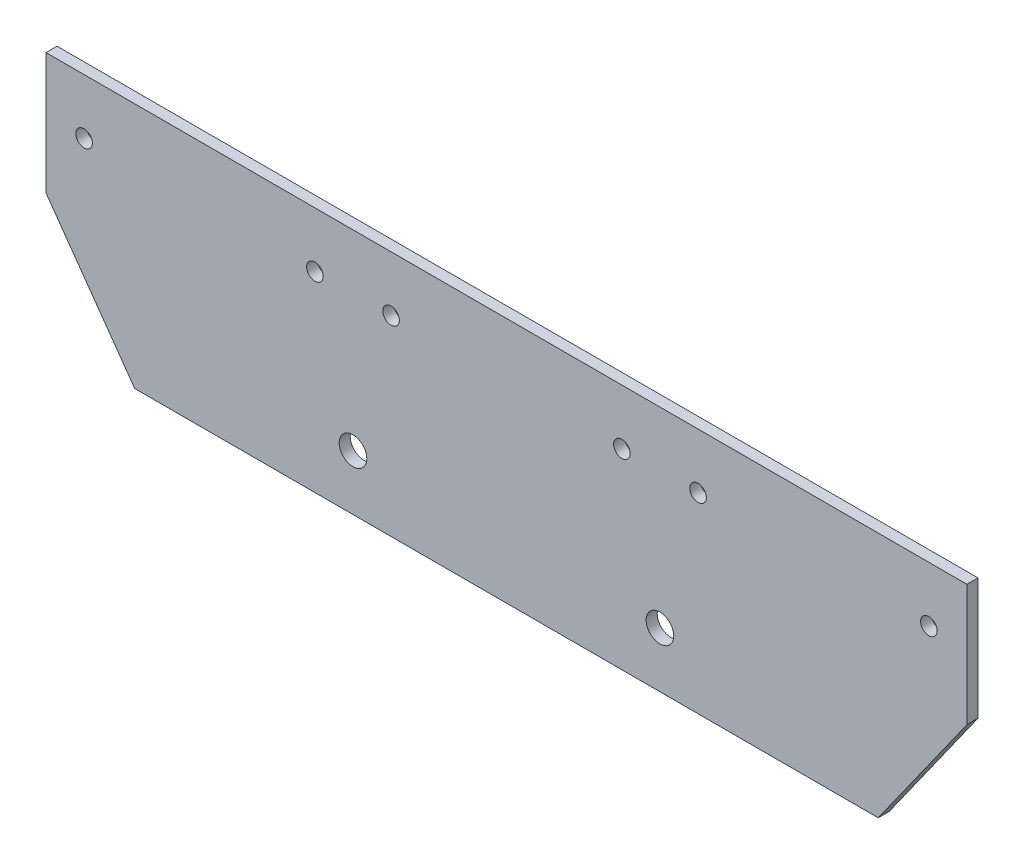
ISO-10303-21;
HEADER;
FILE_DESCRIPTION(('STEP AP214'),'2;1');
FILE_NAME('part.step','',(''),(''),'','','');
FILE_SCHEMA(('AUTOMOTIVE_DESIGN { 1 0 10303 214 1 1 1 1 }'));
ENDSEC;
DATA;
#1=APPLICATION_CONTEXT('core data for automotive mechanical design processes');
#2=APPLICATION_PROTOCOL_DEFINITION('international standard','automotive_design',2000,#1);
#3=PRODUCT_CONTEXT('',#1,'mechanical');
#4=PRODUCT('Part','Part','',(#3));
#5=PRODUCT_RELATED_PRODUCT_CATEGORY('part','',(#4));
#6=PRODUCT_DEFINITION_FORMATION('','',#4);
#7=PRODUCT_DEFINITION_CONTEXT('part definition',#1,'design');
#8=PRODUCT_DEFINITION('design','',#6,#7);
#9=PRODUCT_DEFINITION_SHAPE('','',#8);
#10=(LENGTH_UNIT() NAMED_UNIT(*) SI_UNIT(.MILLI.,.METRE.));
#11=(NAMED_UNIT(*) PLANE_ANGLE_UNIT() SI_UNIT($,.RADIAN.));
#12=(NAMED_UNIT(*) SI_UNIT($,.STERADIAN.) SOLID_ANGLE_UNIT());
#13=UNCERTAINTY_MEASURE_WITH_UNIT(LENGTH_MEASURE(1.E-05),#10,'distance_accuracy_value','');
#14=(GEOMETRIC_REPRESENTATION_CONTEXT(3) GLOBAL_UNCERTAINTY_ASSIGNED_CONTEXT((#13)) GLOBAL_UNIT_ASSIGNED_CONTEXT((#10,
#11,#12)) REPRESENTATION_CONTEXT('',''));
#15=CARTESIAN_POINT('',(0.,0.,0.));
#16=DIRECTION('',(0.,0.,1.));
#17=DIRECTION('',(1.,0.,0.));
#18=AXIS2_PLACEMENT_3D('',#15,#16,#17);
#19=CARTESIAN_POINT('',(43.2797832163817,-30.7058967031871,2.));
#20=DIRECTION('',(0.815585299862001,-0.578636862504464,0.));
#21=DIRECTION('',(0.578636862504464,0.815585299862001,0.));
#22=AXIS2_PLACEMENT_3D('',#19,#20,#21);
#23=PLANE('',#22);
#24=DIRECTION('',(-0.578636862504464,-0.815585299862001,0.));
#25=VECTOR('',#24,1.);
#26=CARTESIAN_POINT('',(43.2797832163817,-30.7058967031871,0.));
#27=LINE('',#26,#25);
#28=CARTESIAN_POINT('',(104.279502218763,55.2728532484216,0.));
#29=VERTEX_POINT('',#28);
#30=CARTESIAN_POINT('',(88.2240973448745,32.6428532484216,0.));
#31=VERTEX_POINT('',#30);
#32=EDGE_CURVE('E158',#29,#31,#27,.T.);
#33=ORIENTED_EDGE('',*,*,#32,.F.);
#34=DIRECTION('',(0.,0.,-1.));
#35=VECTOR('',#34,1.);
#36=CARTESIAN_POINT('',(104.279502218763,55.2728532484216,2.));
#37=LINE('',#36,#35);
#38=CARTESIAN_POINT('',(104.279502218763,55.2728532484216,2.));
#39=VERTEX_POINT('',#38);
#40=EDGE_CURVE('E11',#39,#29,#37,.T.);
#41=ORIENTED_EDGE('',*,*,#40,.F.);
#42=DIRECTION('',(-0.578636862504464,-0.815585299862001,0.));
#43=VECTOR('',#42,1.);
#44=CARTESIAN_POINT('',(43.2797832163817,-30.7058967031871,2.));
#45=LINE('',#44,#43);
#46=CARTESIAN_POINT('',(88.2240973448745,32.6428532484216,2.));
#47=VERTEX_POINT('',#46);
#48=EDGE_CURVE('E200',#39,#47,#45,.T.);
#49=ORIENTED_EDGE('',*,*,#48,.T.);
#50=DIRECTION('',(0.,0.,-1.));
#51=VECTOR('',#50,1.);
#52=CARTESIAN_POINT('',(88.2240973448745,32.6428532484216,2.));
#53=LINE('',#52,#51);
#54=EDGE_CURVE('E93',#47,#31,#53,.T.);
#55=ORIENTED_EDGE('',*,*,#54,.T.);
#56=EDGE_LOOP('',(#33,#41,#49,#55));
#57=FACE_BOUND('',#56,.T.);
#58=ADVANCED_FACE('F47',(#57),#23,.T.);
#59=CARTESIAN_POINT('',(104.279502218763,0.,2.));
#60=DIRECTION('',(-1.,0.,0.));
#61=DIRECTION('',(0.,0.,1.));
#62=AXIS2_PLACEMENT_3D('',#59,#60,#61);
#63=PLANE('',#62);
#64=DIRECTION('',(0.,1.,0.));
#65=VECTOR('',#64,1.);
#66=CARTESIAN_POINT('',(104.279502218763,0.,0.));
#67=LINE('',#66,#65);
#68=CARTESIAN_POINT('',(104.279502218763,77.2728532484216,0.));
#69=VERTEX_POINT('',#68);
#70=EDGE_CURVE('E162',#29,#69,#67,.T.);
#71=ORIENTED_EDGE('',*,*,#70,.T.);
#72=DIRECTION('',(0.,0.,-1.));
#73=VECTOR('',#72,1.);
#74=CARTESIAN_POINT('',(104.279502218763,77.2728532484216,2.));
#75=LINE('',#74,#73);
#76=CARTESIAN_POINT('',(104.279502218763,77.2728532484216,2.));
#77=VERTEX_POINT('',#76);
#78=EDGE_CURVE('E56',#77,#69,#75,.T.);
#79=ORIENTED_EDGE('',*,*,#78,.F.);
#80=DIRECTION('',(0.,1.,0.));
#81=VECTOR('',#80,1.);
#82=CARTESIAN_POINT('',(104.279502218763,0.,2.));
#83=LINE('',#82,#81);
#84=EDGE_CURVE('E221',#39,#77,#83,.T.);
#85=ORIENTED_EDGE('',*,*,#84,.F.);
#86=ORIENTED_EDGE('',*,*,#40,.T.);
#87=EDGE_LOOP('',(#71,#79,#85,#86));
#88=FACE_BOUND('',#87,.T.);
#89=ADVANCED_FACE('F267',(#88),#63,.F.);
#90=CARTESIAN_POINT('',(0.,77.2728532484216,2.));
#91=DIRECTION('',(0.,-1.,0.));
#92=DIRECTION('',(0.,0.,-1.));
#93=AXIS2_PLACEMENT_3D('',#90,#91,#92);
#94=PLANE('',#93);
#95=DIRECTION('',(-1.,0.,0.));
#96=VECTOR('',#95,1.);
#97=CARTESIAN_POINT('',(0.,77.2728532484216,0.));
#98=LINE('',#97,#96);
#99=CARTESIAN_POINT('',(-62.4029270245672,77.2728532484216,0.));
#100=VERTEX_POINT('',#99);
#101=EDGE_CURVE('E166',#69,#100,#98,.T.);
#102=ORIENTED_EDGE('',*,*,#101,.T.);
#103=DIRECTION('',(0.,0.,-1.));
#104=VECTOR('',#103,1.);
#105=CARTESIAN_POINT('',(-62.4029270245672,77.2728532484216,2.));
#106=LINE('',#105,#104);
#107=CARTESIAN_POINT('',(-62.4029270245672,77.2728532484216,2.));
#108=VERTEX_POINT('',#107);
#109=EDGE_CURVE('E124',#108,#100,#106,.T.);
#110=ORIENTED_EDGE('',*,*,#109,.F.);
#111=DIRECTION('',(-1.,0.,0.));
#112=VECTOR('',#111,1.);
#113=CARTESIAN_POINT('',(0.,77.2728532484216,2.));
#114=LINE('',#113,#112);
#115=EDGE_CURVE('E113',#77,#108,#114,.T.);
#116=ORIENTED_EDGE('',*,*,#115,.F.);
#117=ORIENTED_EDGE('',*,*,#78,.T.);
#118=EDGE_LOOP('',(#102,#110,#116,#117));
#119=FACE_BOUND('',#118,.T.);
#120=ADVANCED_FACE('F211',(#119),#94,.F.);
#121=CARTESIAN_POINT('',(-62.4029270245672,0.,2.));
#122=DIRECTION('',(1.,0.,0.));
#123=DIRECTION('',(0.,0.,-1.));
#124=AXIS2_PLACEMENT_3D('',#121,#122,#123);
#125=PLANE('',#124);
#126=DIRECTION('',(0.,-1.,0.));
#127=VECTOR('',#126,1.);
#128=CARTESIAN_POINT('',(-62.4029270245672,0.,0.));
#129=LINE('',#128,#127);
#130=CARTESIAN_POINT('',(-62.4029270245672,55.2728532484216,0.));
#131=VERTEX_POINT('',#130);
#132=EDGE_CURVE('E122',#100,#131,#129,.T.);
#133=ORIENTED_EDGE('',*,*,#132,.T.);
#134=DIRECTION('',(0.,0.,-1.));
#135=VECTOR('',#134,1.);
#136=CARTESIAN_POINT('',(-62.4029270245672,55.2728532484216,2.));
#137=LINE('',#136,#135);
#138=CARTESIAN_POINT('',(-62.4029270245672,55.2728532484216,2.));
#139=VERTEX_POINT('',#138);
#140=EDGE_CURVE('E119',#139,#131,#137,.T.);
#141=ORIENTED_EDGE('',*,*,#140,.F.);
#142=DIRECTION('',(0.,-1.,0.));
#143=VECTOR('',#142,1.);
#144=CARTESIAN_POINT('',(-62.4029270245672,0.,2.));
#145=LINE('',#144,#143);
#146=EDGE_CURVE('E106',#108,#139,#145,.T.);
#147=ORIENTED_EDGE('',*,*,#146,.F.);
#148=ORIENTED_EDGE('',*,*,#109,.T.);
#149=EDGE_LOOP('',(#133,#141,#147,#148));
#150=FACE_BOUND('',#149,.T.);
#151=ADVANCED_FACE('F120',(#150),#125,.F.);
#152=CARTESIAN_POINT('',(-15.4243488356085,-10.9431800915503,2.));
#153=DIRECTION('',(0.815585299862001,0.578636862504464,0.));
#154=DIRECTION('',(-0.578636862504464,0.815585299862001,0.));
#155=AXIS2_PLACEMENT_3D('',#152,#153,#154);
#156=PLANE('',#155);
#157=DIRECTION('',(0.578636862504464,-0.815585299862001,0.));
#158=VECTOR('',#157,1.);
#159=CARTESIAN_POINT('',(-15.4243488356085,-10.9431800915503,0.));
#160=LINE('',#159,#158);
#161=CARTESIAN_POINT('',(-46.3475221506789,32.6428532484216,0.));
#162=VERTEX_POINT('',#161);
#163=EDGE_CURVE('E86',#131,#162,#160,.T.);
#164=ORIENTED_EDGE('',*,*,#163,.T.);
#165=DIRECTION('',(0.,0.,-1.));
#166=VECTOR('',#165,1.);
#167=CARTESIAN_POINT('',(-46.3475221506789,32.6428532484216,2.));
#168=LINE('',#167,#166);
#169=CARTESIAN_POINT('',(-46.3475221506789,32.6428532484216,2.));
#170=VERTEX_POINT('',#169);
#171=EDGE_CURVE('E125',#170,#162,#168,.T.);
#172=ORIENTED_EDGE('',*,*,#171,.F.);
#173=DIRECTION('',(0.578636862504464,-0.815585299862001,0.));
#174=VECTOR('',#173,1.);
#175=CARTESIAN_POINT('',(-15.4243488356085,-10.9431800915503,2.));
#176=LINE('',#175,#174);
#177=EDGE_CURVE('E111',#139,#170,#176,.T.);
#178=ORIENTED_EDGE('',*,*,#177,.F.);
#179=ORIENTED_EDGE('',*,*,#140,.T.);
#180=EDGE_LOOP('',(#164,#172,#178,#179));
#181=FACE_BOUND('',#180,.T.);
#182=ADVANCED_FACE('F127',(#181),#156,.F.);
#183=CARTESIAN_POINT('',(55.6088949079303,67.2728532484216,2.));
#184=DIRECTION('',(0.,0.,-1.));
#185=DIRECTION('',(-1.,0.,0.));
#186=AXIS2_PLACEMENT_3D('',#183,#184,#185);
#187=CYLINDRICAL_SURFACE('',#186,1.49999999999984);
#188=CARTESIAN_POINT('',(55.6088949079303,67.2728532484216,2.));
#189=DIRECTION('',(0.,0.,1.));
#190=DIRECTION('',(1.,0.,0.));
#191=AXIS2_PLACEMENT_3D('',#188,#189,#190);
#192=CIRCLE('',#191,1.49999999999984);
#193=CARTESIAN_POINT('',(57.1088949079301,67.2728532484216,2.));
#194=VERTEX_POINT('',#193);
#195=EDGE_CURVE('E150',#194,#194,#192,.T.);
#196=ORIENTED_EDGE('',*,*,#195,.T.);
#197=EDGE_LOOP('',(#196));
#198=FACE_BOUND('',#197,.T.);
#199=CARTESIAN_POINT('',(55.6088949079303,67.2728532484216,0.));
#200=DIRECTION('',(0.,0.,1.));
#201=DIRECTION('',(1.,0.,0.));
#202=AXIS2_PLACEMENT_3D('',#199,#200,#201);
#203=CIRCLE('',#202,1.49999999999984);
#204=CARTESIAN_POINT('',(57.1088949079301,67.2728532484216,0.));
#205=VERTEX_POINT('',#204);
#206=EDGE_CURVE('E192',#205,#205,#203,.T.);
#207=ORIENTED_EDGE('',*,*,#206,.F.);
#208=EDGE_LOOP('',(#207));
#209=FACE_BOUND('',#208,.T.);
#210=ADVANCED_FACE('F280',(#198,#209),#187,.F.);
#211=CARTESIAN_POINT('',(41.828490034042,67.2728532484215,2.));
#212=DIRECTION('',(0.,0.,-1.));
#213=DIRECTION('',(-1.,0.,0.));
#214=AXIS2_PLACEMENT_3D('',#211,#212,#213);
#215=CYLINDRICAL_SURFACE('',#214,1.49999999999984);
#216=CARTESIAN_POINT('',(41.828490034042,67.2728532484215,2.));
#217=DIRECTION('',(0.,0.,1.));
#218=DIRECTION('',(1.,0.,0.));
#219=AXIS2_PLACEMENT_3D('',#216,#217,#218);
#220=CIRCLE('',#219,1.49999999999984);
#221=CARTESIAN_POINT('',(43.3284900340418,67.2728532484215,2.));
#222=VERTEX_POINT('',#221);
#223=EDGE_CURVE('E146',#222,#222,#220,.T.);
#224=ORIENTED_EDGE('',*,*,#223,.T.);
#225=EDGE_LOOP('',(#224));
#226=FACE_BOUND('',#225,.T.);
#227=CARTESIAN_POINT('',(41.828490034042,67.2728532484215,0.));
#228=DIRECTION('',(0.,0.,1.));
#229=DIRECTION('',(1.,0.,0.));
#230=AXIS2_PLACEMENT_3D('',#227,#228,#229);
#231=CIRCLE('',#230,1.49999999999984);
#232=CARTESIAN_POINT('',(43.3284900340418,67.2728532484215,0.));
#233=VERTEX_POINT('',#232);
#234=EDGE_CURVE('E188',#233,#233,#231,.T.);
#235=ORIENTED_EDGE('',*,*,#234,.F.);
#236=EDGE_LOOP('',(#235));
#237=FACE_BOUND('',#236,.T.);
#238=ADVANCED_FACE('F294',(#226,#237),#215,.F.);
#239=CARTESIAN_POINT('',(0.0480851601536436,67.2728532484215,2.));
#240=DIRECTION('',(0.,0.,-1.));
#241=DIRECTION('',(-1.,0.,0.));
#242=AXIS2_PLACEMENT_3D('',#239,#240,#241);
#243=CYLINDRICAL_SURFACE('',#242,1.49999999999983);
#244=CARTESIAN_POINT('',(0.0480851601536436,67.2728532484215,2.));
#245=DIRECTION('',(0.,0.,1.));
#246=DIRECTION('',(1.,0.,0.));
#247=AXIS2_PLACEMENT_3D('',#244,#245,#246);
#248=CIRCLE('',#247,1.49999999999983);
#249=CARTESIAN_POINT('',(1.54808516015348,67.2728532484215,2.));
#250=VERTEX_POINT('',#249);
#251=EDGE_CURVE('E142',#250,#250,#248,.T.);
#252=ORIENTED_EDGE('',*,*,#251,.T.);
#253=EDGE_LOOP('',(#252));
#254=FACE_BOUND('',#253,.T.);
#255=CARTESIAN_POINT('',(0.0480851601536436,67.2728532484215,0.));
#256=DIRECTION('',(0.,0.,1.));
#257=DIRECTION('',(1.,0.,0.));
#258=AXIS2_PLACEMENT_3D('',#255,#256,#257);
#259=CIRCLE('',#258,1.49999999999983);
#260=CARTESIAN_POINT('',(1.54808516015348,67.2728532484215,0.));
#261=VERTEX_POINT('',#260);
#262=EDGE_CURVE('E184',#261,#261,#259,.T.);
#263=ORIENTED_EDGE('',*,*,#262,.F.);
#264=EDGE_LOOP('',(#263));
#265=FACE_BOUND('',#264,.T.);
#266=ADVANCED_FACE('F290',(#254,#265),#243,.F.);
#267=CARTESIAN_POINT('',(-13.7323197137347,67.2728532484216,2.));
#268=DIRECTION('',(0.,0.,-1.));
#269=DIRECTION('',(-1.,0.,0.));
#270=AXIS2_PLACEMENT_3D('',#267,#268,#269);
#271=CYLINDRICAL_SURFACE('',#270,1.49999999999983);
#272=CARTESIAN_POINT('',(-13.7323197137347,67.2728532484216,2.));
#273=DIRECTION('',(0.,0.,1.));
#274=DIRECTION('',(1.,0.,0.));
#275=AXIS2_PLACEMENT_3D('',#272,#273,#274);
#276=CIRCLE('',#275,1.49999999999983);
#277=CARTESIAN_POINT('',(-12.2323197137348,67.2728532484216,2.));
#278=VERTEX_POINT('',#277);
#279=EDGE_CURVE('E138',#278,#278,#276,.T.);
#280=ORIENTED_EDGE('',*,*,#279,.T.);
#281=EDGE_LOOP('',(#280));
#282=FACE_BOUND('',#281,.T.);
#283=CARTESIAN_POINT('',(-13.7323197137347,67.2728532484216,0.));
#284=DIRECTION('',(0.,0.,1.));
#285=DIRECTION('',(1.,0.,0.));
#286=AXIS2_PLACEMENT_3D('',#283,#284,#285);
#287=CIRCLE('',#286,1.49999999999983);
#288=CARTESIAN_POINT('',(-12.2323197137348,67.2728532484216,0.));
#289=VERTEX_POINT('',#288);
#290=EDGE_CURVE('E180',#289,#289,#287,.T.);
#291=ORIENTED_EDGE('',*,*,#290,.F.);
#292=EDGE_LOOP('',(#291));
#293=FACE_BOUND('',#292,.T.);
#294=ADVANCED_FACE('F286',(#282,#293),#271,.F.);
#295=CARTESIAN_POINT('',(-55.512724587623,67.2728532484216,2.));
#296=DIRECTION('',(0.,0.,-1.));
#297=DIRECTION('',(-1.,0.,0.));
#298=AXIS2_PLACEMENT_3D('',#295,#296,#297);
#299=CYLINDRICAL_SURFACE('',#298,1.49999999999984);
#300=CARTESIAN_POINT('',(-55.512724587623,67.2728532484216,2.));
#301=DIRECTION('',(0.,0.,1.));
#302=DIRECTION('',(1.,0.,0.));
#303=AXIS2_PLACEMENT_3D('',#300,#301,#302);
#304=CIRCLE('',#303,1.49999999999984);
#305=CARTESIAN_POINT('',(-54.0127245876232,67.2728532484216,2.));
#306=VERTEX_POINT('',#305);
#307=EDGE_CURVE('E131',#306,#306,#304,.T.);
#308=ORIENTED_EDGE('',*,*,#307,.T.);
#309=EDGE_LOOP('',(#308));
#310=FACE_BOUND('',#309,.T.);
#311=CARTESIAN_POINT('',(-55.512724587623,67.2728532484216,0.));
#312=DIRECTION('',(0.,0.,1.));
#313=DIRECTION('',(1.,0.,0.));
#314=AXIS2_PLACEMENT_3D('',#311,#312,#313);
#315=CIRCLE('',#314,1.49999999999984);
#316=CARTESIAN_POINT('',(-54.0127245876232,67.2728532484216,0.));
#317=VERTEX_POINT('',#316);
#318=EDGE_CURVE('E176',#317,#317,#315,.T.);
#319=ORIENTED_EDGE('',*,*,#318,.F.);
#320=EDGE_LOOP('',(#319));
#321=FACE_BOUND('',#320,.T.);
#322=ADVANCED_FACE('F283',(#310,#321),#299,.F.);
#323=CARTESIAN_POINT('',(0.,32.6428532484216,2.));
#324=DIRECTION('',(0.,1.,0.));
#325=DIRECTION('',(-1.,0.,0.));
#326=AXIS2_PLACEMENT_3D('',#323,#324,#325);
#327=PLANE('',#326);
#328=DIRECTION('',(1.,0.,0.));
#329=VECTOR('',#328,1.);
#330=CARTESIAN_POINT('',(0.,32.6428532484216,0.));
#331=LINE('',#330,#329);
#332=EDGE_CURVE('E173',#162,#31,#331,.T.);
#333=ORIENTED_EDGE('',*,*,#332,.T.);
#334=ORIENTED_EDGE('',*,*,#54,.F.);
#335=DIRECTION('',(1.,0.,0.));
#336=VECTOR('',#335,1.);
#337=CARTESIAN_POINT('',(0.,32.6428532484216,2.));
#338=LINE('',#337,#336);
#339=EDGE_CURVE('E64',#170,#47,#338,.T.);
#340=ORIENTED_EDGE('',*,*,#339,.F.);
#341=ORIENTED_EDGE('',*,*,#171,.T.);
#342=EDGE_LOOP('',(#333,#334,#340,#341));
#343=FACE_BOUND('',#342,.T.);
#344=ADVANCED_FACE('F219',(#343),#327,.F.);
#345=CARTESIAN_POINT('',(97.3892997818187,67.2728532484216,2.));
#346=DIRECTION('',(0.,0.,-1.));
#347=DIRECTION('',(-1.,0.,0.));
#348=AXIS2_PLACEMENT_3D('',#345,#346,#347);
#349=CYLINDRICAL_SURFACE('',#348,1.49999999999984);
#350=CARTESIAN_POINT('',(97.3892997818187,67.2728532484216,2.));
#351=DIRECTION('',(0.,0.,1.));
#352=DIRECTION('',(1.,0.,0.));
#353=AXIS2_PLACEMENT_3D('',#350,#351,#352);
#354=CIRCLE('',#353,1.49999999999984);
#355=CARTESIAN_POINT('',(98.8892997818185,67.2728532484216,2.));
#356=VERTEX_POINT('',#355);
#357=EDGE_CURVE('E154',#356,#356,#354,.T.);
#358=ORIENTED_EDGE('',*,*,#357,.T.);
#359=EDGE_LOOP('',(#358));
#360=FACE_BOUND('',#359,.T.);
#361=CARTESIAN_POINT('',(97.3892997818187,67.2728532484216,0.));
#362=DIRECTION('',(0.,0.,1.));
#363=DIRECTION('',(1.,0.,0.));
#364=AXIS2_PLACEMENT_3D('',#361,#362,#363);
#365=CIRCLE('',#364,1.49999999999984);
#366=CARTESIAN_POINT('',(98.8892997818185,67.2728532484216,0.));
#367=VERTEX_POINT('',#366);
#368=EDGE_CURVE('E196',#367,#367,#365,.T.);
#369=ORIENTED_EDGE('',*,*,#368,.F.);
#370=EDGE_LOOP('',(#369));
#371=FACE_BOUND('',#370,.T.);
#372=ADVANCED_FACE('F258',(#360,#371),#349,.F.);
#373=CARTESIAN_POINT('',(0.,0.,2.));
#374=DIRECTION('',(0.,0.,1.));
#375=DIRECTION('',(1.,0.,0.));
#376=AXIS2_PLACEMENT_3D('',#373,#374,#375);
#377=PLANE('',#376);
#378=CARTESIAN_POINT('',(48.7186924709861,42.6428532484216,2.));
#379=DIRECTION('',(0.,0.,1.));
#380=DIRECTION('',(1.,0.,0.));
#381=AXIS2_PLACEMENT_3D('',#378,#379,#380);
#382=CIRCLE('',#381,2.5);
#383=CARTESIAN_POINT('',(51.2186924709861,42.6428532484216,2.));
#384=VERTEX_POINT('',#383);
#385=EDGE_CURVE('E163',#384,#384,#382,.F.);
#386=ORIENTED_EDGE('',*,*,#385,.T.);
#387=EDGE_LOOP('',(#386));
#388=FACE_BOUND('',#387,.T.);
#389=CARTESIAN_POINT('',(-6.84211727679051,42.6428532484216,2.));
#390=DIRECTION('',(0.,0.,1.));
#391=DIRECTION('',(1.,0.,0.));
#392=AXIS2_PLACEMENT_3D('',#389,#390,#391);
#393=CIRCLE('',#392,2.5);
#394=CARTESIAN_POINT('',(-4.34211727679051,42.6428532484216,2.));
#395=VERTEX_POINT('',#394);
#396=EDGE_CURVE('E232',#395,#395,#393,.F.);
#397=ORIENTED_EDGE('',*,*,#396,.T.);
#398=EDGE_LOOP('',(#397));
#399=FACE_BOUND('',#398,.T.);
#400=ORIENTED_EDGE('',*,*,#48,.F.);
#401=ORIENTED_EDGE('',*,*,#84,.T.);
#402=ORIENTED_EDGE('',*,*,#115,.T.);
#403=ORIENTED_EDGE('',*,*,#146,.T.);
#404=ORIENTED_EDGE('',*,*,#177,.T.);
#405=ORIENTED_EDGE('',*,*,#339,.T.);
#406=EDGE_LOOP('',(#400,#401,#402,#403,#404,#405));
#407=FACE_BOUND('',#406,.T.);
#408=ORIENTED_EDGE('',*,*,#307,.F.);
#409=EDGE_LOOP('',(#408));
#410=FACE_BOUND('',#409,.T.);
#411=ORIENTED_EDGE('',*,*,#279,.F.);
#412=EDGE_LOOP('',(#411));
#413=FACE_BOUND('',#412,.T.);
#414=ORIENTED_EDGE('',*,*,#251,.F.);
#415=EDGE_LOOP('',(#414));
#416=FACE_BOUND('',#415,.T.);
#417=ORIENTED_EDGE('',*,*,#223,.F.);
#418=EDGE_LOOP('',(#417));
#419=FACE_BOUND('',#418,.T.);
#420=ORIENTED_EDGE('',*,*,#195,.F.);
#421=EDGE_LOOP('',(#420));
#422=FACE_BOUND('',#421,.T.);
#423=ORIENTED_EDGE('',*,*,#357,.F.);
#424=EDGE_LOOP('',(#423));
#425=FACE_BOUND('',#424,.T.);
#426=ADVANCED_FACE('F108',(#388,#399,#407,#410,#413,#416,#419,#422,#425),#377,.T.);
#427=CARTESIAN_POINT('',(0.,0.,0.));
#428=DIRECTION('',(0.,0.,1.));
#429=DIRECTION('',(1.,0.,0.));
#430=AXIS2_PLACEMENT_3D('',#427,#428,#429);
#431=PLANE('',#430);
#432=CARTESIAN_POINT('',(48.7186924709861,42.6428532484216,0.));
#433=DIRECTION('',(0.,0.,-1.));
#434=DIRECTION('',(-1.,0.,0.));
#435=AXIS2_PLACEMENT_3D('',#432,#433,#434);
#436=CIRCLE('',#435,2.5);
#437=CARTESIAN_POINT('',(46.2186924709861,42.6428532484216,0.));
#438=VERTEX_POINT('',#437);
#439=EDGE_CURVE('E231',#438,#438,#436,.T.);
#440=ORIENTED_EDGE('',*,*,#439,.F.);
#441=EDGE_LOOP('',(#440));
#442=FACE_BOUND('',#441,.T.);
#443=CARTESIAN_POINT('',(-6.84211727679051,42.6428532484216,0.));
#444=DIRECTION('',(0.,0.,-1.));
#445=DIRECTION('',(1.,0.,0.));
#446=AXIS2_PLACEMENT_3D('',#443,#444,#445);
#447=CIRCLE('',#446,2.5);
#448=CARTESIAN_POINT('',(-4.34211727679051,42.6428532484216,0.));
#449=VERTEX_POINT('',#448);
#450=EDGE_CURVE('E226',#449,#449,#447,.T.);
#451=ORIENTED_EDGE('',*,*,#450,.F.);
#452=EDGE_LOOP('',(#451));
#453=FACE_BOUND('',#452,.T.);
#454=ORIENTED_EDGE('',*,*,#32,.T.);
#455=ORIENTED_EDGE('',*,*,#332,.F.);
#456=ORIENTED_EDGE('',*,*,#163,.F.);
#457=ORIENTED_EDGE('',*,*,#132,.F.);
#458=ORIENTED_EDGE('',*,*,#101,.F.);
#459=ORIENTED_EDGE('',*,*,#70,.F.);
#460=EDGE_LOOP('',(#454,#455,#456,#457,#458,#459));
#461=FACE_BOUND('',#460,.T.);
#462=ORIENTED_EDGE('',*,*,#318,.T.);
#463=EDGE_LOOP('',(#462));
#464=FACE_BOUND('',#463,.T.);
#465=ORIENTED_EDGE('',*,*,#290,.T.);
#466=EDGE_LOOP('',(#465));
#467=FACE_BOUND('',#466,.T.);
#468=ORIENTED_EDGE('',*,*,#262,.T.);
#469=EDGE_LOOP('',(#468));
#470=FACE_BOUND('',#469,.T.);
#471=ORIENTED_EDGE('',*,*,#234,.T.);
#472=EDGE_LOOP('',(#471));
#473=FACE_BOUND('',#472,.T.);
#474=ORIENTED_EDGE('',*,*,#206,.T.);
#475=EDGE_LOOP('',(#474));
#476=FACE_BOUND('',#475,.T.);
#477=ORIENTED_EDGE('',*,*,#368,.T.);
#478=EDGE_LOOP('',(#477));
#479=FACE_BOUND('',#478,.T.);
#480=ADVANCED_FACE('F215',(#442,#453,#461,#464,#467,#470,#473,#476,#479),#431,.F.);
#481=CARTESIAN_POINT('',(-6.84211727679051,42.6428532484216,9.07106781186548));
#482=DIRECTION('',(0.,0.,-1.));
#483=DIRECTION('',(-1.,0.,0.));
#484=AXIS2_PLACEMENT_3D('',#481,#482,#483);
#485=CYLINDRICAL_SURFACE('',#484,2.5);
#486=ORIENTED_EDGE('',*,*,#450,.T.);
#487=EDGE_LOOP('',(#486));
#488=FACE_BOUND('',#487,.T.);
#489=ORIENTED_EDGE('',*,*,#396,.F.);
#490=EDGE_LOOP('',(#489));
#491=FACE_BOUND('',#490,.T.);
#492=ADVANCED_FACE('F248',(#488,#491),#485,.F.);
#493=CARTESIAN_POINT('',(48.7186924709861,42.6428532484216,9.07106781186548));
#494=DIRECTION('',(0.,0.,-1.));
#495=DIRECTION('',(-1.,0.,0.));
#496=AXIS2_PLACEMENT_3D('',#493,#494,#495);
#497=CYLINDRICAL_SURFACE('',#496,2.5);
#498=ORIENTED_EDGE('',*,*,#439,.T.);
#499=EDGE_LOOP('',(#498));
#500=FACE_BOUND('',#499,.T.);
#501=ORIENTED_EDGE('',*,*,#385,.F.);
#502=EDGE_LOOP('',(#501));
#503=FACE_BOUND('',#502,.T.);
#504=ADVANCED_FACE('F243',(#500,#503),#497,.F.);
#505=CLOSED_SHELL('',(#58,#89,#120,#151,#182,#210,#238,#266,#294,#322,#344,#372,#426,#480,#492,#504));
#506=MANIFOLD_SOLID_BREP('B2',#505);
#507=ADVANCED_BREP_SHAPE_REPRESENTATION('',(#18,#506),#14);
#508=SHAPE_DEFINITION_REPRESENTATION(#9,#507);
ENDSEC;
END-ISO-10303-21;
